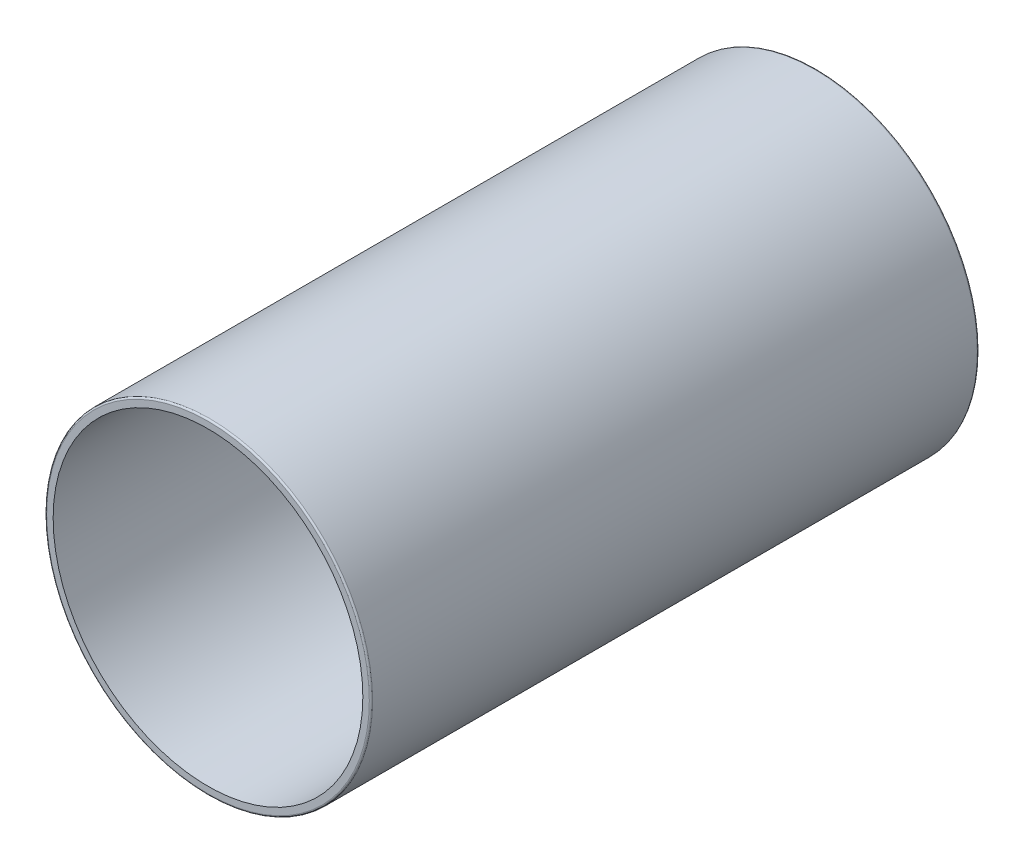
ISO-10303-21;
HEADER;
FILE_DESCRIPTION(('STEP AP214'),'2;1');
FILE_NAME('part.step','',(''),(''),'','','');
FILE_SCHEMA(('AUTOMOTIVE_DESIGN { 1 0 10303 214 1 1 1 1 }'));
ENDSEC;
DATA;
#1=APPLICATION_CONTEXT('core data for automotive mechanical design processes');
#2=APPLICATION_PROTOCOL_DEFINITION('international standard','automotive_design',2000,#1);
#3=PRODUCT_CONTEXT('',#1,'mechanical');
#4=PRODUCT('Part','Part','',(#3));
#5=PRODUCT_RELATED_PRODUCT_CATEGORY('part','',(#4));
#6=PRODUCT_DEFINITION_FORMATION('','',#4);
#7=PRODUCT_DEFINITION_CONTEXT('part definition',#1,'design');
#8=PRODUCT_DEFINITION('design','',#6,#7);
#9=PRODUCT_DEFINITION_SHAPE('','',#8);
#10=(LENGTH_UNIT() NAMED_UNIT(*) SI_UNIT(.MILLI.,.METRE.));
#11=(NAMED_UNIT(*) PLANE_ANGLE_UNIT() SI_UNIT($,.RADIAN.));
#12=(NAMED_UNIT(*) SI_UNIT($,.STERADIAN.) SOLID_ANGLE_UNIT());
#13=UNCERTAINTY_MEASURE_WITH_UNIT(LENGTH_MEASURE(1.E-05),#10,'distance_accuracy_value','');
#14=(GEOMETRIC_REPRESENTATION_CONTEXT(3) GLOBAL_UNCERTAINTY_ASSIGNED_CONTEXT((#13)) GLOBAL_UNIT_ASSIGNED_CONTEXT((#10,
#11,#12)) REPRESENTATION_CONTEXT('',''));
#15=CARTESIAN_POINT('',(0.,0.,0.));
#16=DIRECTION('',(0.,0.,1.));
#17=DIRECTION('',(1.,0.,0.));
#18=AXIS2_PLACEMENT_3D('',#15,#16,#17);
#19=CARTESIAN_POINT('',(0.,0.,750.));
#20=DIRECTION('',(0.,0.,-1.));
#21=DIRECTION('',(-1.,0.,0.));
#22=AXIS2_PLACEMENT_3D('',#19,#20,#21);
#23=CYLINDRICAL_SURFACE('',#22,201.);
#24=CARTESIAN_POINT('',(0.,0.,748.));
#25=DIRECTION('',(0.,0.,1.));
#26=DIRECTION('',(1.,0.,0.));
#27=AXIS2_PLACEMENT_3D('',#24,#25,#26);
#28=CIRCLE('',#27,201.);
#29=CARTESIAN_POINT('',(201.,0.,748.));
#30=VERTEX_POINT('',#29);
#31=EDGE_CURVE('E10',#30,#30,#28,.F.);
#32=ORIENTED_EDGE('',*,*,#31,.T.);
#33=EDGE_LOOP('',(#32));
#34=FACE_BOUND('',#33,.T.);
#35=CARTESIAN_POINT('',(0.,0.,2.));
#36=DIRECTION('',(0.,0.,1.));
#37=DIRECTION('',(1.,0.,0.));
#38=AXIS2_PLACEMENT_3D('',#35,#36,#37);
#39=CIRCLE('',#38,201.);
#40=CARTESIAN_POINT('',(201.,0.,2.));
#41=VERTEX_POINT('',#40);
#42=EDGE_CURVE('E48',#41,#41,#39,.T.);
#43=ORIENTED_EDGE('',*,*,#42,.T.);
#44=EDGE_LOOP('',(#43));
#45=FACE_BOUND('',#44,.T.);
#46=ADVANCED_FACE('F33',(#34,#45),#23,.T.);
#47=CARTESIAN_POINT('',(0.,0.,750.));
#48=DIRECTION('',(0.,0.,1.));
#49=DIRECTION('',(1.,0.,0.));
#50=AXIS2_PLACEMENT_3D('',#47,#48,#49);
#51=PLANE('',#50);
#52=CARTESIAN_POINT('',(0.,0.,750.));
#53=DIRECTION('',(0.,0.,1.));
#54=DIRECTION('',(1.,0.,0.));
#55=AXIS2_PLACEMENT_3D('',#52,#53,#54);
#56=CIRCLE('',#55,199.);
#57=CARTESIAN_POINT('',(199.,0.,750.));
#58=VERTEX_POINT('',#57);
#59=EDGE_CURVE('E40',#58,#58,#56,.T.);
#60=ORIENTED_EDGE('',*,*,#59,.T.);
#61=EDGE_LOOP('',(#60));
#62=FACE_BOUND('',#61,.T.);
#63=CARTESIAN_POINT('',(0.,0.,750.));
#64=DIRECTION('',(0.,0.,1.));
#65=DIRECTION('',(1.,0.,0.));
#66=AXIS2_PLACEMENT_3D('',#63,#64,#65);
#67=CIRCLE('',#66,191.);
#68=CARTESIAN_POINT('',(191.,0.,750.));
#69=VERTEX_POINT('',#68);
#70=EDGE_CURVE('E53',#69,#69,#67,.T.);
#71=ORIENTED_EDGE('',*,*,#70,.F.);
#72=EDGE_LOOP('',(#71));
#73=FACE_BOUND('',#72,.T.);
#74=ADVANCED_FACE('F85',(#62,#73),#51,.T.);
#75=CARTESIAN_POINT('',(0.,0.,0.));
#76=DIRECTION('',(0.,0.,1.));
#77=DIRECTION('',(1.,0.,0.));
#78=AXIS2_PLACEMENT_3D('',#75,#76,#77);
#79=PLANE('',#78);
#80=CARTESIAN_POINT('',(0.,0.,0.));
#81=DIRECTION('',(0.,0.,1.));
#82=DIRECTION('',(1.,0.,0.));
#83=AXIS2_PLACEMENT_3D('',#80,#81,#82);
#84=CIRCLE('',#83,199.);
#85=CARTESIAN_POINT('',(199.,0.,0.));
#86=VERTEX_POINT('',#85);
#87=EDGE_CURVE('E44',#86,#86,#84,.F.);
#88=ORIENTED_EDGE('',*,*,#87,.T.);
#89=EDGE_LOOP('',(#88));
#90=FACE_BOUND('',#89,.T.);
#91=CARTESIAN_POINT('',(0.,0.,0.));
#92=DIRECTION('',(0.,0.,1.));
#93=DIRECTION('',(1.,0.,0.));
#94=AXIS2_PLACEMENT_3D('',#91,#92,#93);
#95=CIRCLE('',#94,192.25);
#96=CARTESIAN_POINT('',(192.25,0.,0.));
#97=VERTEX_POINT('',#96);
#98=EDGE_CURVE('E59',#97,#97,#95,.T.);
#99=ORIENTED_EDGE('',*,*,#98,.T.);
#100=EDGE_LOOP('',(#99));
#101=FACE_BOUND('',#100,.T.);
#102=ADVANCED_FACE('F66',(#90,#101),#79,.F.);
#103=CARTESIAN_POINT('',(0.,0.,750.));
#104=DIRECTION('',(0.,0.,-1.));
#105=DIRECTION('',(-1.,0.,0.));
#106=AXIS2_PLACEMENT_3D('',#103,#104,#105);
#107=CYLINDRICAL_SURFACE('',#106,191.);
#108=ORIENTED_EDGE('',*,*,#70,.T.);
#109=EDGE_LOOP('',(#108));
#110=FACE_BOUND('',#109,.T.);
#111=CARTESIAN_POINT('',(0.,0.,10.));
#112=DIRECTION('',(0.,0.,1.));
#113=DIRECTION('',(1.,0.,0.));
#114=AXIS2_PLACEMENT_3D('',#111,#112,#113);
#115=CIRCLE('',#114,191.);
#116=CARTESIAN_POINT('',(191.,0.,10.));
#117=VERTEX_POINT('',#116);
#118=EDGE_CURVE('E56',#117,#117,#115,.T.);
#119=ORIENTED_EDGE('',*,*,#118,.F.);
#120=EDGE_LOOP('',(#119));
#121=FACE_BOUND('',#120,.T.);
#122=ADVANCED_FACE('F72',(#110,#121),#107,.F.);
#123=CARTESIAN_POINT('',(0.,0.,0.));
#124=DIRECTION('',(0.,0.,1.));
#125=DIRECTION('',(1.,0.,0.));
#126=AXIS2_PLACEMENT_3D('',#123,#124,#125);
#127=CYLINDRICAL_SURFACE('',#126,192.25);
#128=ORIENTED_EDGE('',*,*,#98,.F.);
#129=EDGE_LOOP('',(#128));
#130=FACE_BOUND('',#129,.T.);
#131=CARTESIAN_POINT('',(0.,0.,10.));
#132=DIRECTION('',(0.,0.,1.));
#133=DIRECTION('',(1.,0.,0.));
#134=AXIS2_PLACEMENT_3D('',#131,#132,#133);
#135=CIRCLE('',#134,192.25);
#136=CARTESIAN_POINT('',(192.25,0.,10.));
#137=VERTEX_POINT('',#136);
#138=EDGE_CURVE('E60',#137,#137,#135,.T.);
#139=ORIENTED_EDGE('',*,*,#138,.T.);
#140=EDGE_LOOP('',(#139));
#141=FACE_BOUND('',#140,.T.);
#142=ADVANCED_FACE('F68',(#130,#141),#127,.F.);
#143=CARTESIAN_POINT('',(0.,0.,10.));
#144=DIRECTION('',(0.,0.,1.));
#145=DIRECTION('',(1.,0.,0.));
#146=AXIS2_PLACEMENT_3D('',#143,#144,#145);
#147=PLANE('',#146);
#148=ORIENTED_EDGE('',*,*,#118,.T.);
#149=EDGE_LOOP('',(#148));
#150=FACE_BOUND('',#149,.T.);
#151=ORIENTED_EDGE('',*,*,#138,.F.);
#152=EDGE_LOOP('',(#151));
#153=FACE_BOUND('',#152,.T.);
#154=ADVANCED_FACE('F71',(#150,#153),#147,.F.);
#155=CARTESIAN_POINT('',(0.,0.,2.));
#156=DIRECTION('',(0.,0.,1.));
#157=DIRECTION('',(1.,0.,0.));
#158=AXIS2_PLACEMENT_3D('',#155,#156,#157);
#159=TOROIDAL_SURFACE('',#158,199.,2.);
#160=ORIENTED_EDGE('',*,*,#87,.F.);
#161=EDGE_LOOP('',(#160));
#162=FACE_BOUND('',#161,.T.);
#163=ORIENTED_EDGE('',*,*,#42,.F.);
#164=EDGE_LOOP('',(#163));
#165=FACE_BOUND('',#164,.T.);
#166=ADVANCED_FACE('F77',(#162,#165),#159,.T.);
#167=CARTESIAN_POINT('',(0.,0.,748.));
#168=DIRECTION('',(0.,0.,1.));
#169=DIRECTION('',(1.,0.,0.));
#170=AXIS2_PLACEMENT_3D('',#167,#168,#169);
#171=TOROIDAL_SURFACE('',#170,199.,2.);
#172=ORIENTED_EDGE('',*,*,#31,.F.);
#173=EDGE_LOOP('',(#172));
#174=FACE_BOUND('',#173,.T.);
#175=ORIENTED_EDGE('',*,*,#59,.F.);
#176=EDGE_LOOP('',(#175));
#177=FACE_BOUND('',#176,.T.);
#178=ADVANCED_FACE('F35',(#174,#177),#171,.T.);
#179=CLOSED_SHELL('',(#46,#74,#102,#122,#142,#154,#166,#178));
#180=MANIFOLD_SOLID_BREP('B2',#179);
#181=ADVANCED_BREP_SHAPE_REPRESENTATION('',(#18,#180),#14);
#182=SHAPE_DEFINITION_REPRESENTATION(#9,#181);
ENDSEC;
END-ISO-10303-21;
